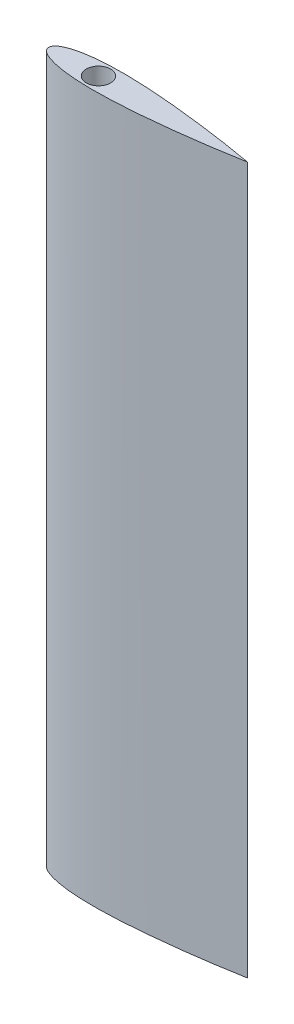
ISO-10303-21;
HEADER;
FILE_DESCRIPTION(('STEP AP214'),'2;1');
FILE_NAME('part.step','',(''),(''),'','','');
FILE_SCHEMA(('AUTOMOTIVE_DESIGN { 1 0 10303 214 1 1 1 1 }'));
ENDSEC;
DATA;
#1=APPLICATION_CONTEXT('core data for automotive mechanical design processes');
#2=APPLICATION_PROTOCOL_DEFINITION('international standard','automotive_design',2000,#1);
#3=PRODUCT_CONTEXT('',#1,'mechanical');
#4=PRODUCT('Part','Part','',(#3));
#5=PRODUCT_RELATED_PRODUCT_CATEGORY('part','',(#4));
#6=PRODUCT_DEFINITION_FORMATION('','',#4);
#7=PRODUCT_DEFINITION_CONTEXT('part definition',#1,'design');
#8=PRODUCT_DEFINITION('design','',#6,#7);
#9=PRODUCT_DEFINITION_SHAPE('','',#8);
#10=(LENGTH_UNIT() NAMED_UNIT(*) SI_UNIT(.MILLI.,.METRE.));
#11=(NAMED_UNIT(*) PLANE_ANGLE_UNIT() SI_UNIT($,.RADIAN.));
#12=(NAMED_UNIT(*) SI_UNIT($,.STERADIAN.) SOLID_ANGLE_UNIT());
#13=UNCERTAINTY_MEASURE_WITH_UNIT(LENGTH_MEASURE(1.E-05),#10,'distance_accuracy_value','');
#14=(GEOMETRIC_REPRESENTATION_CONTEXT(3) GLOBAL_UNCERTAINTY_ASSIGNED_CONTEXT((#13)) GLOBAL_UNIT_ASSIGNED_CONTEXT((#10,
#11,#12)) REPRESENTATION_CONTEXT('',''));
#15=CARTESIAN_POINT('',(0.,0.,0.));
#16=DIRECTION('',(0.,0.,1.));
#17=DIRECTION('',(1.,0.,0.));
#18=AXIS2_PLACEMENT_3D('',#15,#16,#17);
#19=CARTESIAN_POINT('',(25.4966209182363,31.75,3.47540116899455));
#20=DIRECTION('',(0.,-1.,0.));
#21=DIRECTION('',(0.,0.,-1.));
#22=AXIS2_PLACEMENT_3D('',#19,#20,#21);
#23=PLANE('',#22);
#24=CARTESIAN_POINT('',(12.9999694036006,31.75,0.));
#25=DIRECTION('',(0.,1.,0.));
#26=DIRECTION('',(0.,0.,1.));
#27=AXIS2_PLACEMENT_3D('',#24,#25,#26);
#28=CIRCLE('',#27,3.17500000000001);
#29=CARTESIAN_POINT('',(12.9999694036006,31.75,3.17500000000001));
#30=VERTEX_POINT('',#29);
#31=EDGE_CURVE('E172',#30,#30,#28,.T.);
#32=ORIENTED_EDGE('',*,*,#31,.T.);
#33=EDGE_LOOP('',(#32));
#34=FACE_BOUND('',#33,.T.);
#35=CARTESIAN_POINT('',(-4.07951993747658E-05,31.75,-1.95085248361193E-06));
#36=CARTESIAN_POINT('',(-4.0795199570006E-05,31.75,0.139276279302576));
#37=CARTESIAN_POINT('',(0.0468581097208245,31.75,0.417723169954601));
#38=CARTESIAN_POINT('',(0.240290920606621,31.7499999999999,0.792595897127917));
#39=CARTESIAN_POINT('',(0.510646173171032,31.75,1.11327044170082));
#40=CARTESIAN_POINT('',(0.826677060456423,31.75,1.38805500651467));
#41=CARTESIAN_POINT('',(1.17031607247203,31.75,1.62642121219549));
#42=CARTESIAN_POINT('',(1.6527651769989,31.75,1.90586398558623));
#43=CARTESIAN_POINT('',(2.28579130120585,31.75,2.19823689906581));
#44=CARTESIAN_POINT('',(3.07057265224324,31.7500000000001,2.48657930337849));
#45=CARTESIAN_POINT('',(3.87078810532708,31.75,2.7284209309231));
#46=CARTESIAN_POINT('',(4.68100065491605,31.75,2.93367659347665));
#47=CARTESIAN_POINT('',(5.49814965284118,31.75,3.10918101518754));
#48=CARTESIAN_POINT('',(6.3202103731536,31.75,3.25972902299613));
#49=CARTESIAN_POINT('',(7.1459235393999,31.75,3.38866969696014));
#50=CARTESIAN_POINT('',(7.97431801754735,31.75,3.49890562491557));
#51=CARTESIAN_POINT('',(9.08157091260017,31.75,3.62372338211954));
#52=CARTESIAN_POINT('',(10.469449862094,31.75,3.74239445270803));
#53=CARTESIAN_POINT('',(12.1382825500009,31.75,3.83601278494219));
#54=CARTESIAN_POINT('',(13.808880057877,31.7500000000001,3.88849278490973));
#55=CARTESIAN_POINT('',(15.4801839329417,31.7499999999999,3.90551604177455));
#56=CARTESIAN_POINT('',(17.1514995942443,31.7500000000001,3.89193588352729));
#57=CARTESIAN_POINT('',(18.8223670587582,31.7499999999999,3.85149473173316));
#58=CARTESIAN_POINT('',(20.4924866414048,31.75,3.78749734876118));
#59=CARTESIAN_POINT('',(22.7180502090953,31.75,3.67400450869664));
#60=CARTESIAN_POINT('',(25.4973283448359,31.75,3.48549054015055));
#61=CARTESIAN_POINT('',(28.8277384361378,31.75,3.19882336687818));
#62=CARTESIAN_POINT('',(32.1534156074097,31.75,2.86183669628405));
#63=CARTESIAN_POINT('',(35.4743858788434,31.75,2.48151316312112));
#64=CARTESIAN_POINT('',(39.8960814966074,31.75,1.92241515684776));
#65=CARTESIAN_POINT('',(45.4111200951892,31.75,1.13222318485411));
#66=CARTESIAN_POINT('',(49.8074736490414,31.75,0.39835463138979));
#67=CARTESIAN_POINT('',(52.0000000000001,31.75,0.));
#68=B_SPLINE_CURVE_WITH_KNOTS('',3,(#35,#36,#37,#38,#39,#40,#41,#42,#43,#44,#45,#46,#47,#48,#49,
#50,#51,#52,#53,#54,#55,#56,#57,#58,#59,#60,#61,#62,#63,#64,#65,#66,#67),.UNSPECIFIED.,.F.,.F.,
(4,1,1,1,1,1,1,1,1,1,1,1,1,1,1,1,1,1,1,1,1,1,1,1,1,1,1,1,1,1,4),(0.49999299407246,
0.503899298806269,0.507805603540078,0.511711908273887,0.515618213007696,0.519524517741505,
0.523430822475313,0.531243431942931,0.539056041410549,0.546868650878167,0.554681260345785,
0.562493869813403,0.57030647928102,0.578119088748638,0.585931698216256,0.593744307683874,
0.609369526619109,0.624994745554345,0.64061996448958,0.656245183424816,0.671870402360052,
0.687495621295288,0.703120840230523,0.718746059165759,0.74999649703623,0.781246934906701,
0.812497372777172,0.843747810647644,0.874998248518115,0.937499124259058,1.),.UNSPECIFIED.);
#69=CARTESIAN_POINT('',(-4.07951993748035E-05,31.75,-1.9508524835523E-06));
#70=VERTEX_POINT('',#69);
#71=CARTESIAN_POINT('',(52.0000000000001,31.75,0.));
#72=VERTEX_POINT('',#71);
#73=EDGE_CURVE('E78',#70,#72,#68,.T.);
#74=ORIENTED_EDGE('',*,*,#73,.F.);
#75=CARTESIAN_POINT('',(52.0000000000001,31.75,0.));
#76=CARTESIAN_POINT('',(49.8074736700273,31.75,-0.398354627576909));
#77=CARTESIAN_POINT('',(45.4111200789346,31.75,-1.13222318780736));
#78=CARTESIAN_POINT('',(39.8960815036035,31.75,-1.92241515557666));
#79=CARTESIAN_POINT('',(35.4743858759427,31.75,-2.48151316364814));
#80=CARTESIAN_POINT('',(32.1534156091599,31.75,-2.86183669596606));
#81=CARTESIAN_POINT('',(28.8277384351893,31.75,-3.19882336705051));
#82=CARTESIAN_POINT('',(25.4973283453847,31.7500000000001,-3.48549054005083));
#83=CARTESIAN_POINT('',(22.7180502088707,31.7499999999999,-3.67400450873744));
#84=CARTESIAN_POINT('',(20.4924866415136,31.7500000000001,-3.78749734874143));
#85=CARTESIAN_POINT('',(18.8223670586965,31.75,-3.85149473174436));
#86=CARTESIAN_POINT('',(17.151499594281,31.75,-3.89193588352062));
#87=CARTESIAN_POINT('',(15.4801839329195,31.75,-3.90551604177859));
#88=CARTESIAN_POINT('',(13.8088800578891,31.75,-3.88849278490753));
#89=CARTESIAN_POINT('',(12.1382825499951,31.75,-3.83601278494328));
#90=CARTESIAN_POINT('',(10.4694498620971,31.75,-3.74239445270742));
#91=CARTESIAN_POINT('',(9.08157091259868,31.75,-3.62372338211989));
#92=CARTESIAN_POINT('',(7.97431801754802,31.75,-3.49890562491532));
#93=CARTESIAN_POINT('',(7.14592353939959,31.75,-3.38866969696048));
#94=CARTESIAN_POINT('',(6.32021037315379,31.75,-3.2597290229956));
#95=CARTESIAN_POINT('',(5.49814965284109,31.75,-3.1091810151887));
#96=CARTESIAN_POINT('',(4.68100065491612,31.7500000000001,-2.93367659347386));
#97=CARTESIAN_POINT('',(3.87078810532707,31.75,-2.7284209309287));
#98=CARTESIAN_POINT('',(3.07057265224324,31.7500000000001,-2.48657930336742));
#99=CARTESIAN_POINT('',(2.28579130120583,31.75,-2.19823689908634));
#100=CARTESIAN_POINT('',(1.65276517699892,31.75,-1.90586398554853));
#101=CARTESIAN_POINT('',(1.17031607247199,31.75,-1.62642121225749));
#102=CARTESIAN_POINT('',(0.826677060456468,31.75,-1.38805500636789));
#103=CARTESIAN_POINT('',(0.510646173170942,31.75,-1.11327044198337));
#104=CARTESIAN_POINT('',(0.240290920606757,31.75,-0.792595896657961));
#105=CARTESIAN_POINT('',(0.0468581097205408,31.75,-0.417723170915954));
#106=CARTESIAN_POINT('',(-4.07951991795311E-05,31.75,-0.139276277969481));
#107=CARTESIAN_POINT('',(-4.07951993747658E-05,31.75,-1.95085248361193E-06));
#108=B_SPLINE_CURVE_WITH_KNOTS('',3,(#75,#76,#77,#78,#79,#80,#81,#82,#83,#84,#85,#86,#87,#88,
#89,#90,#91,#92,#93,#94,#95,#96,#97,#98,#99,#100,#101,#102,#103,#104,#105,#106,#107),
.UNSPECIFIED.,.F.,.F.,(4,1,1,1,1,1,1,1,1,1,1,1,1,1,1,1,1,1,1,1,1,1,1,1,1,1,1,1,1,1,4),(0.,
0.0624991242590575,0.124998248518115,0.156247810647644,0.187497372777172,0.218746934906701,
0.24999649703623,0.281246059165759,0.296870840230523,0.312495621295288,0.328120402360052,
0.343745183424816,0.35936996448958,0.374994745554345,0.390619526619109,0.406244307683874,
0.414056698216256,0.421869088748638,0.42968147928102,0.437493869813402,0.445306260345785,
0.453118650878167,0.460931041410549,0.468743431942931,0.476555822475313,0.480462017741504,
0.484368213007696,0.488274408273887,0.492180603540078,0.496086798806269,0.49999299407246),.UNSPECIFIED.);
#109=EDGE_CURVE('E81',#72,#70,#108,.T.);
#110=ORIENTED_EDGE('',*,*,#109,.F.);
#111=EDGE_LOOP('',(#74,#110));
#112=FACE_BOUND('',#111,.T.);
#113=ADVANCED_FACE('F51',(#34,#112),#23,.T.);
#114=CARTESIAN_POINT('',(25.4966209182363,216.6684,3.47540116899455));
#115=DIRECTION('',(0.,-1.,0.));
#116=DIRECTION('',(0.,0.,-1.));
#117=AXIS2_PLACEMENT_3D('',#114,#115,#116);
#118=PLANE('',#117);
#119=CARTESIAN_POINT('',(12.9999694036006,216.6684,0.));
#120=DIRECTION('',(0.,-1.,0.));
#121=DIRECTION('',(0.,0.,-1.));
#122=AXIS2_PLACEMENT_3D('',#119,#120,#121);
#123=CIRCLE('',#122,3.17500000000001);
#124=CARTESIAN_POINT('',(12.9999694036006,216.6684,-3.17500000000001));
#125=VERTEX_POINT('',#124);
#126=EDGE_CURVE('E55',#125,#125,#123,.F.);
#127=ORIENTED_EDGE('',*,*,#126,.F.);
#128=EDGE_LOOP('',(#127));
#129=FACE_BOUND('',#128,.T.);
#130=CARTESIAN_POINT('',(52.0000000000001,216.6684,0.));
#131=CARTESIAN_POINT('',(49.8074736490414,216.6684,0.39835463138979));
#132=CARTESIAN_POINT('',(45.4111200951892,216.6684,1.13222318485411));
#133=CARTESIAN_POINT('',(39.8960814966074,216.6684,1.92241515684776));
#134=CARTESIAN_POINT('',(35.4743858788434,216.6684,2.48151316312112));
#135=CARTESIAN_POINT('',(32.1534156074097,216.6684,2.86183669628405));
#136=CARTESIAN_POINT('',(28.8277384361378,216.6684,3.19882336687818));
#137=CARTESIAN_POINT('',(25.4973283448359,216.6684,3.48549054015055));
#138=CARTESIAN_POINT('',(22.7180502090953,216.6684,3.67400450869664));
#139=CARTESIAN_POINT('',(20.4924866414048,216.6684,3.78749734876118));
#140=CARTESIAN_POINT('',(18.8223670587582,216.6684,3.85149473173316));
#141=CARTESIAN_POINT('',(17.1514995942443,216.6684,3.89193588352729));
#142=CARTESIAN_POINT('',(15.4801839329417,216.6684,3.90551604177455));
#143=CARTESIAN_POINT('',(13.808880057877,216.6684,3.88849278490973));
#144=CARTESIAN_POINT('',(12.1382825500009,216.6684,3.83601278494219));
#145=CARTESIAN_POINT('',(10.469449862094,216.6684,3.74239445270803));
#146=CARTESIAN_POINT('',(9.08157091260017,216.6684,3.62372338211954));
#147=CARTESIAN_POINT('',(7.97431801754735,216.6684,3.49890562491557));
#148=CARTESIAN_POINT('',(7.1459235393999,216.6684,3.38866969696014));
#149=CARTESIAN_POINT('',(6.3202103731536,216.668400000001,3.25972902299613));
#150=CARTESIAN_POINT('',(5.49814965284118,216.6684,3.10918101518754));
#151=CARTESIAN_POINT('',(4.68100065491605,216.6684,2.93367659347665));
#152=CARTESIAN_POINT('',(3.87078810532708,216.6684,2.7284209309231));
#153=CARTESIAN_POINT('',(3.07057265224324,216.6684,2.48657930337849));
#154=CARTESIAN_POINT('',(2.28579130120585,216.6684,2.19823689906581));
#155=CARTESIAN_POINT('',(1.6527651769989,216.6684,1.90586398558623));
#156=CARTESIAN_POINT('',(1.17031607247203,216.6684,1.62642121219549));
#157=CARTESIAN_POINT('',(0.826677060456423,216.6684,1.38805500651467));
#158=CARTESIAN_POINT('',(0.510646173171032,216.6684,1.11327044170082));
#159=CARTESIAN_POINT('',(0.240290920606621,216.6684,0.792595897127917));
#160=CARTESIAN_POINT('',(0.0468581097208245,216.6684,0.417723169954601));
#161=CARTESIAN_POINT('',(-4.0795199570006E-05,216.6684,0.139276279302576));
#162=CARTESIAN_POINT('',(-4.07951993747658E-05,216.6684,-1.95085248361193E-06));
#163=B_SPLINE_CURVE_WITH_KNOTS('',3,(#130,#131,#132,#133,#134,#135,#136,#137,#138,#139,#140,
#141,#142,#143,#144,#145,#146,#147,#148,#149,#150,#151,#152,#153,#154,#155,#156,#157,#158,#159,
#160,#161,#162),.UNSPECIFIED.,.F.,.F.,(4,1,1,1,1,1,1,1,1,1,1,1,1,1,1,1,1,1,1,1,1,1,1,1,1,1,1,1,
1,1,4),(0.49999299407246,0.562493869813403,0.624994745554345,0.656245183424816,
0.687495621295288,0.718746059165759,0.74999649703623,0.781246934906701,0.796872153841937,
0.812497372777173,0.828122591712408,0.843747810647644,0.85937302958288,0.874998248518115,
0.890623467453351,0.906248686388586,0.914061295856204,0.921873905323822,0.92968651479144,
0.937499124259058,0.945311733726675,0.953124343194293,0.960936952661911,0.968749562129529,
0.976562171597147,0.980468476330956,0.984374781064765,0.988281085798573,0.992187390532382,
0.996093695266191,1.),.UNSPECIFIED.);
#164=CARTESIAN_POINT('',(-4.07951993748035E-05,216.6684,-1.9508524835523E-06));
#165=VERTEX_POINT('',#164);
#166=CARTESIAN_POINT('',(52.0000000000001,216.6684,0.));
#167=VERTEX_POINT('',#166);
#168=EDGE_CURVE('E69',#165,#167,#163,.F.);
#169=ORIENTED_EDGE('',*,*,#168,.T.);
#170=CARTESIAN_POINT('',(-4.07951993747658E-05,216.6684,-1.95085248361193E-06));
#171=CARTESIAN_POINT('',(-4.07951991795311E-05,216.6684,-0.139276277969481));
#172=CARTESIAN_POINT('',(0.0468581097205408,216.6684,-0.417723170915954));
#173=CARTESIAN_POINT('',(0.240290920606757,216.6684,-0.792595896657961));
#174=CARTESIAN_POINT('',(0.510646173170942,216.6684,-1.11327044198337));
#175=CARTESIAN_POINT('',(0.826677060456468,216.6684,-1.38805500636789));
#176=CARTESIAN_POINT('',(1.17031607247199,216.6684,-1.62642121225749));
#177=CARTESIAN_POINT('',(1.65276517699892,216.6684,-1.90586398554853));
#178=CARTESIAN_POINT('',(2.28579130120583,216.6684,-2.19823689908634));
#179=CARTESIAN_POINT('',(3.07057265224324,216.668400000001,-2.48657930336742));
#180=CARTESIAN_POINT('',(3.87078810532707,216.6684,-2.7284209309287));
#181=CARTESIAN_POINT('',(4.68100065491612,216.6684,-2.93367659347386));
#182=CARTESIAN_POINT('',(5.49814965284109,216.6684,-3.1091810151887));
#183=CARTESIAN_POINT('',(6.32021037315379,216.6684,-3.2597290229956));
#184=CARTESIAN_POINT('',(7.14592353939959,216.6684,-3.38866969696048));
#185=CARTESIAN_POINT('',(7.97431801754802,216.6684,-3.49890562491532));
#186=CARTESIAN_POINT('',(9.08157091259868,216.6684,-3.62372338211989));
#187=CARTESIAN_POINT('',(10.4694498620971,216.668400000001,-3.74239445270742));
#188=CARTESIAN_POINT('',(12.1382825499951,216.6684,-3.83601278494328));
#189=CARTESIAN_POINT('',(13.8088800578891,216.6684,-3.88849278490753));
#190=CARTESIAN_POINT('',(15.4801839329195,216.6684,-3.90551604177859));
#191=CARTESIAN_POINT('',(17.151499594281,216.6684,-3.89193588352062));
#192=CARTESIAN_POINT('',(18.8223670586965,216.6684,-3.85149473174436));
#193=CARTESIAN_POINT('',(20.4924866415136,216.6684,-3.78749734874143));
#194=CARTESIAN_POINT('',(22.7180502088707,216.668400000001,-3.67400450873744));
#195=CARTESIAN_POINT('',(25.4973283453847,216.6684,-3.48549054005083));
#196=CARTESIAN_POINT('',(28.8277384351893,216.6684,-3.19882336705051));
#197=CARTESIAN_POINT('',(32.1534156091599,216.6684,-2.86183669596606));
#198=CARTESIAN_POINT('',(35.4743858759427,216.6684,-2.48151316364814));
#199=CARTESIAN_POINT('',(39.8960815036035,216.6684,-1.92241515557666));
#200=CARTESIAN_POINT('',(45.4111200789346,216.6684,-1.13222318780736));
#201=CARTESIAN_POINT('',(49.8074736700273,216.6684,-0.398354627576909));
#202=CARTESIAN_POINT('',(52.0000000000001,216.6684,0.));
#203=B_SPLINE_CURVE_WITH_KNOTS('',3,(#170,#171,#172,#173,#174,#175,#176,#177,#178,#179,#180,
#181,#182,#183,#184,#185,#186,#187,#188,#189,#190,#191,#192,#193,#194,#195,#196,#197,#198,#199,
#200,#201,#202),.UNSPECIFIED.,.F.,.F.,(4,1,1,1,1,1,1,1,1,1,1,1,1,1,1,1,1,1,1,1,1,1,1,1,1,1,1,1,
1,1,4),(0.,0.00390619526619118,0.00781239053238231,0.0117185857985734,0.0156247810647645,
0.0195309763309556,0.0234371715971467,0.0312495621295289,0.0390619526619111,0.0468743431942933,
0.0546867337266754,0.0624991242590576,0.0703115147914398,0.0781239053238219,0.0859362958562042,
0.0937486863885864,0.109373467453351,0.124998248518115,0.14062302958288,0.156247810647644,
0.171872591712408,0.187497372777172,0.203122153841937,0.218746934906701,0.24999649703623,
0.281246059165759,0.312495621295288,0.343745183424816,0.374994745554345,0.437493869813403,
0.49999299407246),.UNSPECIFIED.);
#204=EDGE_CURVE('E92',#167,#165,#203,.F.);
#205=ORIENTED_EDGE('',*,*,#204,.T.);
#206=EDGE_LOOP('',(#169,#205));
#207=FACE_BOUND('',#206,.T.);
#208=ADVANCED_FACE('F116',(#129,#207),#118,.F.);
#209=CARTESIAN_POINT('',(52.0000000000001,31.75,0.));
#210=CARTESIAN_POINT('',(52.0000000000001,216.6684,0.));
#211=CARTESIAN_POINT('',(49.8074736700273,31.75,-0.398354627576909));
#212=CARTESIAN_POINT('',(49.8074736700273,216.6684,-0.398354627576909));
#213=CARTESIAN_POINT('',(45.4111200789346,31.75,-1.13222318780736));
#214=CARTESIAN_POINT('',(45.4111200789346,216.6684,-1.13222318780736));
#215=CARTESIAN_POINT('',(39.8960815036035,31.75,-1.92241515557666));
#216=CARTESIAN_POINT('',(39.8960815036035,216.6684,-1.92241515557666));
#217=CARTESIAN_POINT('',(35.4743858759427,31.75,-2.48151316364814));
#218=CARTESIAN_POINT('',(35.4743858759427,216.6684,-2.48151316364814));
#219=CARTESIAN_POINT('',(32.1534156091599,31.75,-2.86183669596606));
#220=CARTESIAN_POINT('',(32.1534156091599,216.6684,-2.86183669596606));
#221=CARTESIAN_POINT('',(28.8277384351893,31.75,-3.19882336705051));
#222=CARTESIAN_POINT('',(28.8277384351893,216.6684,-3.19882336705051));
#223=CARTESIAN_POINT('',(25.4973283453847,31.7500000000001,-3.48549054005083));
#224=CARTESIAN_POINT('',(25.4973283453847,216.6684,-3.48549054005083));
#225=CARTESIAN_POINT('',(22.7180502088707,31.7499999999999,-3.67400450873744));
#226=CARTESIAN_POINT('',(22.7180502088707,216.668400000001,-3.67400450873744));
#227=CARTESIAN_POINT('',(20.4924866415136,31.7500000000001,-3.78749734874143));
#228=CARTESIAN_POINT('',(20.4924866415136,216.6684,-3.78749734874143));
#229=CARTESIAN_POINT('',(18.8223670586965,31.75,-3.85149473174436));
#230=CARTESIAN_POINT('',(18.8223670586965,216.6684,-3.85149473174436));
#231=CARTESIAN_POINT('',(17.151499594281,31.75,-3.89193588352062));
#232=CARTESIAN_POINT('',(17.151499594281,216.6684,-3.89193588352062));
#233=CARTESIAN_POINT('',(15.4801839329195,31.75,-3.90551604177859));
#234=CARTESIAN_POINT('',(15.4801839329195,216.6684,-3.90551604177859));
#235=CARTESIAN_POINT('',(13.8088800578891,31.75,-3.88849278490753));
#236=CARTESIAN_POINT('',(13.8088800578891,216.6684,-3.88849278490753));
#237=CARTESIAN_POINT('',(12.1382825499951,31.75,-3.83601278494328));
#238=CARTESIAN_POINT('',(12.1382825499951,216.6684,-3.83601278494328));
#239=CARTESIAN_POINT('',(10.4694498620971,31.75,-3.74239445270742));
#240=CARTESIAN_POINT('',(10.4694498620971,216.668400000001,-3.74239445270742));
#241=CARTESIAN_POINT('',(9.08157091259868,31.75,-3.62372338211989));
#242=CARTESIAN_POINT('',(9.08157091259868,216.6684,-3.62372338211989));
#243=CARTESIAN_POINT('',(7.97431801754802,31.75,-3.49890562491532));
#244=CARTESIAN_POINT('',(7.97431801754802,216.6684,-3.49890562491532));
#245=CARTESIAN_POINT('',(7.14592353939959,31.75,-3.38866969696048));
#246=CARTESIAN_POINT('',(7.14592353939959,216.6684,-3.38866969696048));
#247=CARTESIAN_POINT('',(6.32021037315379,31.75,-3.2597290229956));
#248=CARTESIAN_POINT('',(6.32021037315379,216.6684,-3.2597290229956));
#249=CARTESIAN_POINT('',(5.49814965284109,31.75,-3.1091810151887));
#250=CARTESIAN_POINT('',(5.49814965284109,216.6684,-3.1091810151887));
#251=CARTESIAN_POINT('',(4.68100065491612,31.7500000000001,-2.93367659347386));
#252=CARTESIAN_POINT('',(4.68100065491612,216.6684,-2.93367659347386));
#253=CARTESIAN_POINT('',(3.87078810532707,31.75,-2.7284209309287));
#254=CARTESIAN_POINT('',(3.87078810532707,216.6684,-2.7284209309287));
#255=CARTESIAN_POINT('',(3.07057265224324,31.7500000000001,-2.48657930336742));
#256=CARTESIAN_POINT('',(3.07057265224324,216.668400000001,-2.48657930336742));
#257=CARTESIAN_POINT('',(2.28579130120583,31.75,-2.19823689908634));
#258=CARTESIAN_POINT('',(2.28579130120583,216.6684,-2.19823689908634));
#259=CARTESIAN_POINT('',(1.65276517699892,31.75,-1.90586398554853));
#260=CARTESIAN_POINT('',(1.65276517699892,216.6684,-1.90586398554853));
#261=CARTESIAN_POINT('',(1.17031607247199,31.75,-1.62642121225749));
#262=CARTESIAN_POINT('',(1.17031607247199,216.6684,-1.62642121225749));
#263=CARTESIAN_POINT('',(0.826677060456468,31.75,-1.38805500636789));
#264=CARTESIAN_POINT('',(0.826677060456468,216.6684,-1.38805500636789));
#265=CARTESIAN_POINT('',(0.510646173170942,31.75,-1.11327044198337));
#266=CARTESIAN_POINT('',(0.510646173170942,216.6684,-1.11327044198337));
#267=CARTESIAN_POINT('',(0.240290920606757,31.75,-0.792595896657961));
#268=CARTESIAN_POINT('',(0.240290920606757,216.6684,-0.792595896657961));
#269=CARTESIAN_POINT('',(0.0468581097205408,31.75,-0.417723170915954));
#270=CARTESIAN_POINT('',(0.0468581097205408,216.6684,-0.417723170915954));
#271=CARTESIAN_POINT('',(-4.07951991795311E-05,31.75,-0.139276277969481));
#272=CARTESIAN_POINT('',(-4.07951991795311E-05,216.6684,-0.139276277969481));
#273=CARTESIAN_POINT('',(-4.07951993747658E-05,31.75,-1.95085248361193E-06));
#274=CARTESIAN_POINT('',(-4.07951993747658E-05,216.6684,-1.95085248361193E-06));
#275=B_SPLINE_SURFACE_WITH_KNOTS('',3,1,((#209,#210),(#211,#212),(#213,#214),(#215,#216),(#217,
#218),(#219,#220),(#221,#222),(#223,#224),(#225,#226),(#227,#228),(#229,#230),(#231,#232),(#233,
#234),(#235,#236),(#237,#238),(#239,#240),(#241,#242),(#243,#244),(#245,#246),(#247,#248),(#249,
#250),(#251,#252),(#253,#254),(#255,#256),(#257,#258),(#259,#260),(#261,#262),(#263,#264),(#265,
#266),(#267,#268),(#269,#270),(#271,#272),(#273,#274)),.UNSPECIFIED.,.F.,.F.,.F.,(4,1,1,1,1,1,1,
1,1,1,1,1,1,1,1,1,1,1,1,1,1,1,1,1,1,1,1,1,1,1,4),(2,2),(0.,0.0624991242590575,0.124998248518115,
0.156247810647644,0.187497372777172,0.218746934906701,0.24999649703623,0.281246059165759,
0.296870840230523,0.312495621295288,0.328120402360052,0.343745183424816,0.35936996448958,
0.374994745554345,0.390619526619109,0.406244307683874,0.414056698216256,0.421869088748638,
0.42968147928102,0.437493869813402,0.445306260345785,0.453118650878167,0.460931041410549,
0.468743431942931,0.476555822475313,0.480462017741504,0.484368213007696,0.488274408273887,
0.492180603540078,0.496086798806269,0.49999299407246),(0.,1.),.UNSPECIFIED.);
#276=DIRECTION('',(0.,1.,0.));
#277=VECTOR('',#276,1.);
#278=CARTESIAN_POINT('',(-4.07951993747658E-05,124.2092,-1.95085248361193E-06));
#279=LINE('',#278,#277);
#280=EDGE_CURVE('E61',#70,#165,#279,.T.);
#281=DIRECTION('',(0.,1.,0.));
#282=VECTOR('',#281,1.);
#283=CARTESIAN_POINT('',(52.0000000000001,124.2092,0.));
#284=LINE('',#283,#282);
#285=EDGE_CURVE('E12',#72,#167,#284,.T.);
#286=ORIENTED_EDGE('',*,*,#109,.T.);
#287=ORIENTED_EDGE('',*,*,#280,.T.);
#288=ORIENTED_EDGE('',*,*,#204,.F.);
#289=ORIENTED_EDGE('',*,*,#285,.F.);
#290=EDGE_LOOP('',(#286,#287,#288,#289));
#291=FACE_BOUND('',#290,.T.);
#292=ADVANCED_FACE('F95',(#291),#275,.T.);
#293=CARTESIAN_POINT('',(-4.07951993747658E-05,31.75,-1.95085248361193E-06));
#294=CARTESIAN_POINT('',(-4.07951993747658E-05,216.6684,-1.95085248361193E-06));
#295=CARTESIAN_POINT('',(-4.0795199570006E-05,31.75,0.139276279302576));
#296=CARTESIAN_POINT('',(-4.0795199570006E-05,216.6684,0.139276279302576));
#297=CARTESIAN_POINT('',(0.0468581097208245,31.75,0.417723169954601));
#298=CARTESIAN_POINT('',(0.0468581097208245,216.6684,0.417723169954601));
#299=CARTESIAN_POINT('',(0.240290920606621,31.7499999999999,0.792595897127917));
#300=CARTESIAN_POINT('',(0.240290920606621,216.6684,0.792595897127917));
#301=CARTESIAN_POINT('',(0.510646173171032,31.75,1.11327044170082));
#302=CARTESIAN_POINT('',(0.510646173171032,216.6684,1.11327044170082));
#303=CARTESIAN_POINT('',(0.826677060456423,31.75,1.38805500651467));
#304=CARTESIAN_POINT('',(0.826677060456423,216.6684,1.38805500651467));
#305=CARTESIAN_POINT('',(1.17031607247203,31.75,1.62642121219549));
#306=CARTESIAN_POINT('',(1.17031607247203,216.6684,1.62642121219549));
#307=CARTESIAN_POINT('',(1.6527651769989,31.75,1.90586398558623));
#308=CARTESIAN_POINT('',(1.6527651769989,216.6684,1.90586398558623));
#309=CARTESIAN_POINT('',(2.28579130120585,31.75,2.19823689906581));
#310=CARTESIAN_POINT('',(2.28579130120585,216.6684,2.19823689906581));
#311=CARTESIAN_POINT('',(3.07057265224324,31.7500000000001,2.48657930337849));
#312=CARTESIAN_POINT('',(3.07057265224324,216.6684,2.48657930337849));
#313=CARTESIAN_POINT('',(3.87078810532708,31.75,2.7284209309231));
#314=CARTESIAN_POINT('',(3.87078810532708,216.6684,2.7284209309231));
#315=CARTESIAN_POINT('',(4.68100065491605,31.75,2.93367659347665));
#316=CARTESIAN_POINT('',(4.68100065491605,216.6684,2.93367659347665));
#317=CARTESIAN_POINT('',(5.49814965284118,31.75,3.10918101518754));
#318=CARTESIAN_POINT('',(5.49814965284118,216.6684,3.10918101518754));
#319=CARTESIAN_POINT('',(6.3202103731536,31.75,3.25972902299613));
#320=CARTESIAN_POINT('',(6.3202103731536,216.668400000001,3.25972902299613));
#321=CARTESIAN_POINT('',(7.1459235393999,31.75,3.38866969696014));
#322=CARTESIAN_POINT('',(7.1459235393999,216.6684,3.38866969696014));
#323=CARTESIAN_POINT('',(7.97431801754735,31.75,3.49890562491557));
#324=CARTESIAN_POINT('',(7.97431801754735,216.6684,3.49890562491557));
#325=CARTESIAN_POINT('',(9.08157091260017,31.75,3.62372338211954));
#326=CARTESIAN_POINT('',(9.08157091260017,216.6684,3.62372338211954));
#327=CARTESIAN_POINT('',(10.469449862094,31.75,3.74239445270803));
#328=CARTESIAN_POINT('',(10.469449862094,216.6684,3.74239445270803));
#329=CARTESIAN_POINT('',(12.1382825500009,31.75,3.83601278494219));
#330=CARTESIAN_POINT('',(12.1382825500009,216.6684,3.83601278494219));
#331=CARTESIAN_POINT('',(13.808880057877,31.7500000000001,3.88849278490973));
#332=CARTESIAN_POINT('',(13.808880057877,216.6684,3.88849278490973));
#333=CARTESIAN_POINT('',(15.4801839329417,31.7499999999999,3.90551604177455));
#334=CARTESIAN_POINT('',(15.4801839329417,216.6684,3.90551604177455));
#335=CARTESIAN_POINT('',(17.1514995942443,31.7500000000001,3.89193588352729));
#336=CARTESIAN_POINT('',(17.1514995942443,216.6684,3.89193588352729));
#337=CARTESIAN_POINT('',(18.8223670587582,31.7499999999999,3.85149473173316));
#338=CARTESIAN_POINT('',(18.8223670587582,216.6684,3.85149473173316));
#339=CARTESIAN_POINT('',(20.4924866414048,31.75,3.78749734876118));
#340=CARTESIAN_POINT('',(20.4924866414048,216.6684,3.78749734876118));
#341=CARTESIAN_POINT('',(22.7180502090953,31.75,3.67400450869664));
#342=CARTESIAN_POINT('',(22.7180502090953,216.6684,3.67400450869664));
#343=CARTESIAN_POINT('',(25.4973283448359,31.75,3.48549054015055));
#344=CARTESIAN_POINT('',(25.4973283448359,216.6684,3.48549054015055));
#345=CARTESIAN_POINT('',(28.8277384361378,31.75,3.19882336687818));
#346=CARTESIAN_POINT('',(28.8277384361378,216.6684,3.19882336687818));
#347=CARTESIAN_POINT('',(32.1534156074097,31.75,2.86183669628405));
#348=CARTESIAN_POINT('',(32.1534156074097,216.6684,2.86183669628405));
#349=CARTESIAN_POINT('',(35.4743858788434,31.75,2.48151316312112));
#350=CARTESIAN_POINT('',(35.4743858788434,216.6684,2.48151316312112));
#351=CARTESIAN_POINT('',(39.8960814966074,31.75,1.92241515684776));
#352=CARTESIAN_POINT('',(39.8960814966074,216.6684,1.92241515684776));
#353=CARTESIAN_POINT('',(45.4111200951892,31.75,1.13222318485411));
#354=CARTESIAN_POINT('',(45.4111200951892,216.6684,1.13222318485411));
#355=CARTESIAN_POINT('',(49.8074736490414,31.75,0.39835463138979));
#356=CARTESIAN_POINT('',(49.8074736490414,216.6684,0.39835463138979));
#357=CARTESIAN_POINT('',(52.0000000000001,31.75,0.));
#358=CARTESIAN_POINT('',(52.0000000000001,216.6684,0.));
#359=B_SPLINE_SURFACE_WITH_KNOTS('',3,1,((#293,#294),(#295,#296),(#297,#298),(#299,#300),(#301,
#302),(#303,#304),(#305,#306),(#307,#308),(#309,#310),(#311,#312),(#313,#314),(#315,#316),(#317,
#318),(#319,#320),(#321,#322),(#323,#324),(#325,#326),(#327,#328),(#329,#330),(#331,#332),(#333,
#334),(#335,#336),(#337,#338),(#339,#340),(#341,#342),(#343,#344),(#345,#346),(#347,#348),(#349,
#350),(#351,#352),(#353,#354),(#355,#356),(#357,#358)),.UNSPECIFIED.,.F.,.F.,.F.,(4,1,1,1,1,1,1,
1,1,1,1,1,1,1,1,1,1,1,1,1,1,1,1,1,1,1,1,1,1,1,4),(2,2),(0.49999299407246,0.503899298806269,
0.507805603540078,0.511711908273887,0.515618213007696,0.519524517741505,0.523430822475313,
0.531243431942931,0.539056041410549,0.546868650878167,0.554681260345785,0.562493869813403,
0.57030647928102,0.578119088748638,0.585931698216256,0.593744307683874,0.609369526619109,
0.624994745554345,0.64061996448958,0.656245183424816,0.671870402360052,0.687495621295288,
0.703120840230523,0.718746059165759,0.74999649703623,0.781246934906701,0.812497372777172,
0.843747810647644,0.874998248518115,0.937499124259058,1.),(0.,1.),.UNSPECIFIED.);
#360=ORIENTED_EDGE('',*,*,#73,.T.);
#361=ORIENTED_EDGE('',*,*,#285,.T.);
#362=ORIENTED_EDGE('',*,*,#168,.F.);
#363=ORIENTED_EDGE('',*,*,#280,.F.);
#364=EDGE_LOOP('',(#360,#361,#362,#363));
#365=FACE_BOUND('',#364,.T.);
#366=ADVANCED_FACE('F91',(#365),#359,.T.);
#367=CARTESIAN_POINT('',(12.9999694036006,216.670756005943,0.));
#368=DIRECTION('',(0.,-1.,0.));
#369=DIRECTION('',(0.,0.,-1.));
#370=AXIS2_PLACEMENT_3D('',#367,#368,#369);
#371=CYLINDRICAL_SURFACE('',#370,3.17500000000001);
#372=ORIENTED_EDGE('',*,*,#31,.F.);
#373=EDGE_LOOP('',(#372));
#374=FACE_BOUND('',#373,.T.);
#375=ORIENTED_EDGE('',*,*,#126,.T.);
#376=EDGE_LOOP('',(#375));
#377=FACE_BOUND('',#376,.T.);
#378=ADVANCED_FACE('F117',(#374,#377),#371,.F.);
#379=CLOSED_SHELL('',(#113,#208,#292,#366,#378));
#380=MANIFOLD_SOLID_BREP('B2',#379);
#381=ADVANCED_BREP_SHAPE_REPRESENTATION('',(#18,#380),#14);
#382=SHAPE_DEFINITION_REPRESENTATION(#9,#381);
ENDSEC;
END-ISO-10303-21;
